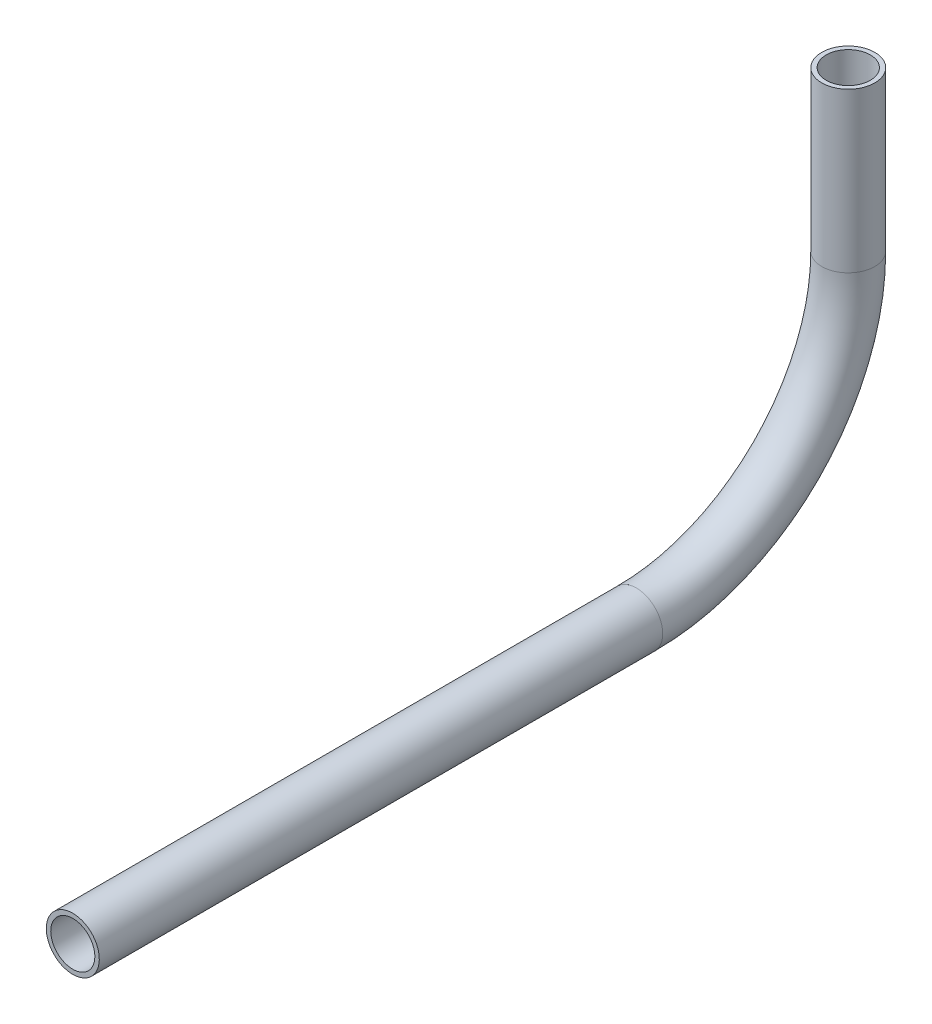
ISO-10303-21;
HEADER;
FILE_DESCRIPTION(('STEP AP214'),'2;1');
FILE_NAME('part.step','',(''),(''),'','','');
FILE_SCHEMA(('AUTOMOTIVE_DESIGN { 1 0 10303 214 1 1 1 1 }'));
ENDSEC;
DATA;
#1=APPLICATION_CONTEXT('core data for automotive mechanical design processes');
#2=APPLICATION_PROTOCOL_DEFINITION('international standard','automotive_design',2000,#1);
#3=PRODUCT_CONTEXT('',#1,'mechanical');
#4=PRODUCT('Part','Part','',(#3));
#5=PRODUCT_RELATED_PRODUCT_CATEGORY('part','',(#4));
#6=PRODUCT_DEFINITION_FORMATION('','',#4);
#7=PRODUCT_DEFINITION_CONTEXT('part definition',#1,'design');
#8=PRODUCT_DEFINITION('design','',#6,#7);
#9=PRODUCT_DEFINITION_SHAPE('','',#8);
#10=(LENGTH_UNIT() NAMED_UNIT(*) SI_UNIT(.MILLI.,.METRE.));
#11=(NAMED_UNIT(*) PLANE_ANGLE_UNIT() SI_UNIT($,.RADIAN.));
#12=(NAMED_UNIT(*) SI_UNIT($,.STERADIAN.) SOLID_ANGLE_UNIT());
#13=UNCERTAINTY_MEASURE_WITH_UNIT(LENGTH_MEASURE(1.E-05),#10,'distance_accuracy_value','');
#14=(GEOMETRIC_REPRESENTATION_CONTEXT(3) GLOBAL_UNCERTAINTY_ASSIGNED_CONTEXT((#13)) GLOBAL_UNIT_ASSIGNED_CONTEXT((#10,
#11,#12)) REPRESENTATION_CONTEXT('',''));
#15=CARTESIAN_POINT('',(0.,0.,0.));
#16=DIRECTION('',(0.,0.,1.));
#17=DIRECTION('',(1.,0.,0.));
#18=AXIS2_PLACEMENT_3D('',#15,#16,#17);
#19=CARTESIAN_POINT('',(0.,670.165576631268,168.173580131087));
#20=DIRECTION('',(0.,0.,1.));
#21=DIRECTION('',(0.,-1.,0.));
#22=AXIS2_PLACEMENT_3D('',#19,#20,#21);
#23=CYLINDRICAL_SURFACE('',#22,5.28320000000004);
#24=CARTESIAN_POINT('',(0.,670.165576631268,303.16459571102));
#25=DIRECTION('',(0.,0.,-1.));
#26=DIRECTION('',(0.,1.,0.));
#27=AXIS2_PLACEMENT_3D('',#24,#25,#26);
#28=CIRCLE('',#27,5.28320000000004);
#29=CARTESIAN_POINT('',(0.,675.448776631268,303.16459571102));
#30=VERTEX_POINT('',#29);
#31=EDGE_CURVE('E61',#30,#30,#28,.T.);
#32=ORIENTED_EDGE('',*,*,#31,.F.);
#33=EDGE_LOOP('',(#32));
#34=FACE_BOUND('',#33,.T.);
#35=CARTESIAN_POINT('',(0.,670.165576631268,168.173580131087));
#36=DIRECTION('',(0.,0.,-1.));
#37=DIRECTION('',(0.,1.,0.));
#38=AXIS2_PLACEMENT_3D('',#35,#36,#37);
#39=CIRCLE('',#38,5.28320000000004);
#40=CARTESIAN_POINT('',(0.,675.448776631268,168.173580131087));
#41=VERTEX_POINT('',#40);
#42=EDGE_CURVE('E57',#41,#41,#39,.T.);
#43=ORIENTED_EDGE('',*,*,#42,.T.);
#44=EDGE_LOOP('',(#43));
#45=FACE_BOUND('',#44,.T.);
#46=ADVANCED_FACE('F53',(#34,#45),#23,.F.);
#47=CARTESIAN_POINT('',(0.,670.165576631268,168.173580131087));
#48=DIRECTION('',(0.,0.,1.));
#49=DIRECTION('',(0.,-1.,0.));
#50=AXIS2_PLACEMENT_3D('',#47,#48,#49);
#51=CYLINDRICAL_SURFACE('',#50,6.35000000000005);
#52=CARTESIAN_POINT('',(0.,670.165576631268,303.16459571102));
#53=DIRECTION('',(0.,0.,-1.));
#54=DIRECTION('',(0.,1.,0.));
#55=AXIS2_PLACEMENT_3D('',#52,#53,#54);
#56=CIRCLE('',#55,6.35000000000005);
#57=CARTESIAN_POINT('',(0.,676.515576631268,303.16459571102));
#58=VERTEX_POINT('',#57);
#59=EDGE_CURVE('E65',#58,#58,#56,.T.);
#60=ORIENTED_EDGE('',*,*,#59,.T.);
#61=EDGE_LOOP('',(#60));
#62=FACE_BOUND('',#61,.T.);
#63=CARTESIAN_POINT('',(0.,670.165576631268,168.173580131087));
#64=DIRECTION('',(0.,0.,-1.));
#65=DIRECTION('',(0.,1.,0.));
#66=AXIS2_PLACEMENT_3D('',#63,#64,#65);
#67=CIRCLE('',#66,6.35000000000005);
#68=CARTESIAN_POINT('',(0.,676.515576631268,168.173580131087));
#69=VERTEX_POINT('',#68);
#70=EDGE_CURVE('E12',#69,#69,#67,.T.);
#71=ORIENTED_EDGE('',*,*,#70,.F.);
#72=EDGE_LOOP('',(#71));
#73=FACE_BOUND('',#72,.T.);
#74=ADVANCED_FACE('F80',(#62,#73),#51,.T.);
#75=CARTESIAN_POINT('',(0.,670.165576631268,303.16459571102));
#76=DIRECTION('',(0.,0.,-1.));
#77=DIRECTION('',(0.,1.,0.));
#78=AXIS2_PLACEMENT_3D('',#75,#76,#77);
#79=PLANE('',#78);
#80=ORIENTED_EDGE('',*,*,#31,.T.);
#81=EDGE_LOOP('',(#80));
#82=FACE_BOUND('',#81,.T.);
#83=ORIENTED_EDGE('',*,*,#59,.F.);
#84=EDGE_LOOP('',(#83));
#85=FACE_BOUND('',#84,.T.);
#86=ADVANCED_FACE('F76',(#82,#85),#79,.F.);
#87=CARTESIAN_POINT('',(0.,670.165576631268,168.173580131087));
#88=DIRECTION('',(0.,0.,-1.));
#89=DIRECTION('',(0.,1.,0.));
#90=AXIS2_PLACEMENT_3D('',#87,#88,#89);
#91=PLANE('',#90);
#92=ORIENTED_EDGE('',*,*,#42,.F.);
#93=EDGE_LOOP('',(#92));
#94=FACE_BOUND('',#93,.T.);
#95=ORIENTED_EDGE('',*,*,#70,.T.);
#96=EDGE_LOOP('',(#95));
#97=FACE_BOUND('',#96,.T.);
#98=ADVANCED_FACE('F55',(#94,#97),#91,.T.);
#99=CLOSED_SHELL('',(#46,#74,#86,#98));
#100=MANIFOLD_SOLID_BREP('B2',#99);
#101=CARTESIAN_POINT('',(0.,720.965576631268,168.173580131087));
#102=DIRECTION('',(-1.,0.,0.));
#103=DIRECTION('',(0.,0.,1.));
#104=AXIS2_PLACEMENT_3D('',#101,#102,#103);
#105=TOROIDAL_SURFACE('',#104,50.8000000000001,5.28320000000004);
#106=CARTESIAN_POINT('',(0.,720.965576631268,117.373580131087));
#107=DIRECTION('',(0.,1.,0.));
#108=DIRECTION('',(0.,0.,1.));
#109=AXIS2_PLACEMENT_3D('',#106,#107,#108);
#110=CIRCLE('',#109,5.28320000000004);
#111=CARTESIAN_POINT('',(0.,720.965576631268,112.090380131087));
#112=VERTEX_POINT('',#111);
#113=EDGE_CURVE('E162',#112,#112,#110,.T.);
#114=CARTESIAN_POINT('',(0.,670.165576631268,168.173580131087));
#115=DIRECTION('',(0.,0.,1.));
#116=DIRECTION('',(0.,-1.,0.));
#117=AXIS2_PLACEMENT_3D('',#114,#115,#116);
#118=CIRCLE('',#117,5.28320000000004);
#119=CARTESIAN_POINT('',(0.,664.882376631268,168.173580131087));
#120=VERTEX_POINT('',#119);
#121=EDGE_CURVE('E152',#120,#120,#118,.T.);
#122=CARTESIAN_POINT('',(0.,720.965576631268,168.173580131087));
#123=DIRECTION('',(-1.,0.,0.));
#124=DIRECTION('',(0.,0.,1.));
#125=AXIS2_PLACEMENT_3D('',#122,#123,#124);
#126=CIRCLE('',#125,56.0832000000001);
#127=EDGE_CURVE('',#112,#120,#126,.T.);
#128=ORIENTED_EDGE('',*,*,#113,.T.);
#129=ORIENTED_EDGE('',*,*,#121,.T.);
#130=ORIENTED_EDGE('',*,*,#127,.T.);
#131=ORIENTED_EDGE('',*,*,#127,.F.);
#132=EDGE_LOOP('',(#128,#130,#129,#131));
#133=FACE_BOUND('',#132,.T.);
#134=ADVANCED_FACE('F148',(#133),#105,.F.);
#135=CARTESIAN_POINT('',(0.,720.965576631268,168.173580131087));
#136=DIRECTION('',(-1.,0.,0.));
#137=DIRECTION('',(0.,0.,1.));
#138=AXIS2_PLACEMENT_3D('',#135,#136,#137);
#139=TOROIDAL_SURFACE('',#138,50.8000000000001,6.35000000000005);
#140=CARTESIAN_POINT('',(0.,720.965576631268,117.373580131087));
#141=DIRECTION('',(0.,1.,0.));
#142=DIRECTION('',(0.,0.,1.));
#143=AXIS2_PLACEMENT_3D('',#140,#141,#142);
#144=CIRCLE('',#143,6.35000000000005);
#145=CARTESIAN_POINT('',(0.,720.965576631268,111.023580131087));
#146=VERTEX_POINT('',#145);
#147=EDGE_CURVE('E156',#146,#146,#144,.T.);
#148=CARTESIAN_POINT('',(0.,670.165576631268,168.173580131087));
#149=DIRECTION('',(0.,0.,1.));
#150=DIRECTION('',(0.,-1.,0.));
#151=AXIS2_PLACEMENT_3D('',#148,#149,#150);
#152=CIRCLE('',#151,6.35000000000005);
#153=CARTESIAN_POINT('',(0.,663.815576631268,168.173580131087));
#154=VERTEX_POINT('',#153);
#155=EDGE_CURVE('E52',#154,#154,#152,.T.);
#156=CARTESIAN_POINT('',(0.,720.965576631268,168.173580131087));
#157=DIRECTION('',(-1.,0.,0.));
#158=DIRECTION('',(0.,0.,1.));
#159=AXIS2_PLACEMENT_3D('',#156,#157,#158);
#160=CIRCLE('',#159,57.1500000000001);
#161=EDGE_CURVE('',#146,#154,#160,.T.);
#162=ORIENTED_EDGE('',*,*,#147,.F.);
#163=ORIENTED_EDGE('',*,*,#155,.F.);
#164=ORIENTED_EDGE('',*,*,#161,.T.);
#165=ORIENTED_EDGE('',*,*,#161,.F.);
#166=EDGE_LOOP('',(#162,#164,#163,#165));
#167=FACE_BOUND('',#166,.T.);
#168=ADVANCED_FACE('F175',(#167),#139,.T.);
#169=CARTESIAN_POINT('',(0.,720.965576631268,117.373580131087));
#170=DIRECTION('',(0.,1.,0.));
#171=DIRECTION('',(0.,0.,1.));
#172=AXIS2_PLACEMENT_3D('',#169,#170,#171);
#173=PLANE('',#172);
#174=ORIENTED_EDGE('',*,*,#113,.F.);
#175=EDGE_LOOP('',(#174));
#176=FACE_BOUND('',#175,.T.);
#177=ORIENTED_EDGE('',*,*,#147,.T.);
#178=EDGE_LOOP('',(#177));
#179=FACE_BOUND('',#178,.T.);
#180=ADVANCED_FACE('F171',(#176,#179),#173,.T.);
#181=CARTESIAN_POINT('',(0.,670.165576631268,168.173580131087));
#182=DIRECTION('',(0.,0.,1.));
#183=DIRECTION('',(0.,-1.,0.));
#184=AXIS2_PLACEMENT_3D('',#181,#182,#183);
#185=PLANE('',#184);
#186=ORIENTED_EDGE('',*,*,#121,.F.);
#187=EDGE_LOOP('',(#186));
#188=FACE_BOUND('',#187,.T.);
#189=ORIENTED_EDGE('',*,*,#155,.T.);
#190=EDGE_LOOP('',(#189));
#191=FACE_BOUND('',#190,.T.);
#192=ADVANCED_FACE('F150',(#188,#191),#185,.T.);
#193=CLOSED_SHELL('',(#134,#168,#180,#192));
#194=MANIFOLD_SOLID_BREP('B7',#193);
#195=CARTESIAN_POINT('',(0.,759.065576631268,117.373580131087));
#196=DIRECTION('',(0.,-1.,0.));
#197=DIRECTION('',(0.,0.,-1.));
#198=AXIS2_PLACEMENT_3D('',#195,#196,#197);
#199=CYLINDRICAL_SURFACE('',#198,5.28320000000004);
#200=CARTESIAN_POINT('',(0.,759.065576631268,117.373580131087));
#201=DIRECTION('',(0.,1.,0.));
#202=DIRECTION('',(0.,0.,1.));
#203=AXIS2_PLACEMENT_3D('',#200,#201,#202);
#204=CIRCLE('',#203,5.28320000000004);
#205=CARTESIAN_POINT('',(0.,759.065576631268,122.656780131087));
#206=VERTEX_POINT('',#205);
#207=EDGE_CURVE('E244',#206,#206,#204,.T.);
#208=ORIENTED_EDGE('',*,*,#207,.T.);
#209=EDGE_LOOP('',(#208));
#210=FACE_BOUND('',#209,.T.);
#211=CARTESIAN_POINT('',(0.,720.965576631268,117.373580131087));
#212=DIRECTION('',(0.,-1.,0.));
#213=DIRECTION('',(0.,0.,-1.));
#214=AXIS2_PLACEMENT_3D('',#211,#212,#213);
#215=CIRCLE('',#214,5.28320000000004);
#216=CARTESIAN_POINT('',(0.,720.965576631268,112.090380131087));
#217=VERTEX_POINT('',#216);
#218=EDGE_CURVE('E234',#217,#217,#215,.T.);
#219=ORIENTED_EDGE('',*,*,#218,.T.);
#220=EDGE_LOOP('',(#219));
#221=FACE_BOUND('',#220,.T.);
#222=ADVANCED_FACE('F230',(#210,#221),#199,.F.);
#223=CARTESIAN_POINT('',(0.,759.065576631268,117.373580131087));
#224=DIRECTION('',(0.,-1.,0.));
#225=DIRECTION('',(0.,0.,-1.));
#226=AXIS2_PLACEMENT_3D('',#223,#224,#225);
#227=CYLINDRICAL_SURFACE('',#226,6.35000000000005);
#228=CARTESIAN_POINT('',(0.,759.065576631268,117.373580131087));
#229=DIRECTION('',(0.,1.,0.));
#230=DIRECTION('',(0.,0.,1.));
#231=AXIS2_PLACEMENT_3D('',#228,#229,#230);
#232=CIRCLE('',#231,6.35000000000005);
#233=CARTESIAN_POINT('',(0.,759.065576631268,123.723580131087));
#234=VERTEX_POINT('',#233);
#235=EDGE_CURVE('E238',#234,#234,#232,.T.);
#236=ORIENTED_EDGE('',*,*,#235,.F.);
#237=EDGE_LOOP('',(#236));
#238=FACE_BOUND('',#237,.T.);
#239=CARTESIAN_POINT('',(0.,720.965576631268,117.373580131087));
#240=DIRECTION('',(0.,-1.,0.));
#241=DIRECTION('',(0.,0.,-1.));
#242=AXIS2_PLACEMENT_3D('',#239,#240,#241);
#243=CIRCLE('',#242,6.35000000000005);
#244=CARTESIAN_POINT('',(0.,720.965576631268,111.023580131087));
#245=VERTEX_POINT('',#244);
#246=EDGE_CURVE('E147',#245,#245,#243,.T.);
#247=ORIENTED_EDGE('',*,*,#246,.F.);
#248=EDGE_LOOP('',(#247));
#249=FACE_BOUND('',#248,.T.);
#250=ADVANCED_FACE('F257',(#238,#249),#227,.T.);
#251=CARTESIAN_POINT('',(0.,759.065576631268,117.373580131087));
#252=DIRECTION('',(0.,1.,0.));
#253=DIRECTION('',(0.,0.,1.));
#254=AXIS2_PLACEMENT_3D('',#251,#252,#253);
#255=PLANE('',#254);
#256=ORIENTED_EDGE('',*,*,#207,.F.);
#257=EDGE_LOOP('',(#256));
#258=FACE_BOUND('',#257,.T.);
#259=ORIENTED_EDGE('',*,*,#235,.T.);
#260=EDGE_LOOP('',(#259));
#261=FACE_BOUND('',#260,.T.);
#262=ADVANCED_FACE('F253',(#258,#261),#255,.T.);
#263=CARTESIAN_POINT('',(0.,720.965576631268,117.373580131087));
#264=DIRECTION('',(0.,-1.,0.));
#265=DIRECTION('',(0.,0.,-1.));
#266=AXIS2_PLACEMENT_3D('',#263,#264,#265);
#267=PLANE('',#266);
#268=ORIENTED_EDGE('',*,*,#218,.F.);
#269=EDGE_LOOP('',(#268));
#270=FACE_BOUND('',#269,.T.);
#271=ORIENTED_EDGE('',*,*,#246,.T.);
#272=EDGE_LOOP('',(#271));
#273=FACE_BOUND('',#272,.T.);
#274=ADVANCED_FACE('F232',(#270,#273),#267,.T.);
#275=CLOSED_SHELL('',(#222,#250,#262,#274));
#276=MANIFOLD_SOLID_BREP('B47',#275);
#277=ADVANCED_BREP_SHAPE_REPRESENTATION('',(#18,#100,#194,#276),#14);
#278=SHAPE_DEFINITION_REPRESENTATION(#9,#277);
ENDSEC;
END-ISO-10303-21;
